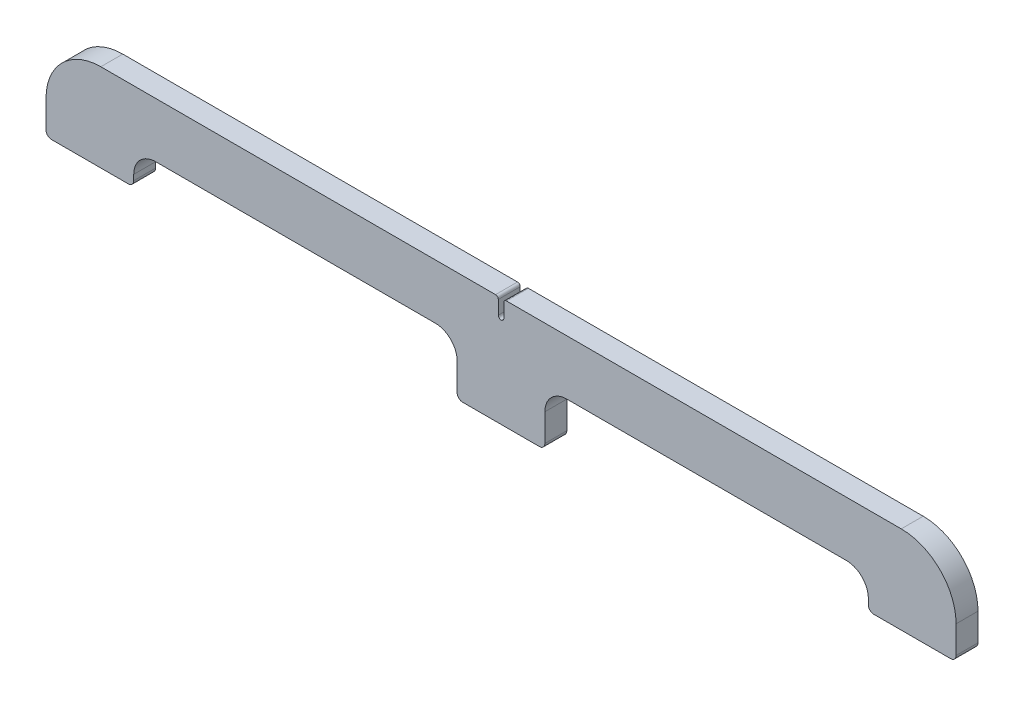
ISO-10303-21;
HEADER;
FILE_DESCRIPTION(('STEP AP214'),'2;1');
FILE_NAME('part.step','',(''),(''),'','','');
FILE_SCHEMA(('AUTOMOTIVE_DESIGN { 1 0 10303 214 1 1 1 1 }'));
ENDSEC;
DATA;
#1=APPLICATION_CONTEXT('core data for automotive mechanical design processes');
#2=APPLICATION_PROTOCOL_DEFINITION('international standard','automotive_design',2000,#1);
#3=PRODUCT_CONTEXT('',#1,'mechanical');
#4=PRODUCT('Part','Part','',(#3));
#5=PRODUCT_RELATED_PRODUCT_CATEGORY('part','',(#4));
#6=PRODUCT_DEFINITION_FORMATION('','',#4);
#7=PRODUCT_DEFINITION_CONTEXT('part definition',#1,'design');
#8=PRODUCT_DEFINITION('design','',#6,#7);
#9=PRODUCT_DEFINITION_SHAPE('','',#8);
#10=(LENGTH_UNIT() NAMED_UNIT(*) SI_UNIT(.MILLI.,.METRE.));
#11=(NAMED_UNIT(*) PLANE_ANGLE_UNIT() SI_UNIT($,.RADIAN.));
#12=(NAMED_UNIT(*) SI_UNIT($,.STERADIAN.) SOLID_ANGLE_UNIT());
#13=UNCERTAINTY_MEASURE_WITH_UNIT(LENGTH_MEASURE(1.E-05),#10,'distance_accuracy_value','');
#14=(GEOMETRIC_REPRESENTATION_CONTEXT(3) GLOBAL_UNCERTAINTY_ASSIGNED_CONTEXT((#13)) GLOBAL_UNIT_ASSIGNED_CONTEXT((#10,
#11,#12)) REPRESENTATION_CONTEXT('',''));
#15=CARTESIAN_POINT('',(0.,0.,0.));
#16=DIRECTION('',(0.,0.,1.));
#17=DIRECTION('',(1.,0.,0.));
#18=AXIS2_PLACEMENT_3D('',#15,#16,#17);
#19=CARTESIAN_POINT('',(131.7625,12.7,3.175));
#20=DIRECTION('',(0.,-1.,0.));
#21=DIRECTION('',(0.,0.,-1.));
#22=AXIS2_PLACEMENT_3D('',#19,#20,#21);
#23=PLANE('',#22);
#24=DIRECTION('',(-1.,0.,0.));
#25=VECTOR('',#24,1.);
#26=CARTESIAN_POINT('',(131.7625,12.7,3.175));
#27=LINE('',#26,#25);
#28=CARTESIAN_POINT('',(-1.58749999999999,12.7,3.175));
#29=VERTEX_POINT('',#28);
#30=CARTESIAN_POINT('',(-115.8875,12.7,3.175));
#31=VERTEX_POINT('',#30);
#32=EDGE_CURVE('E357',#29,#31,#27,.T.);
#33=ORIENTED_EDGE('',*,*,#32,.F.);
#34=DIRECTION('',(0.,0.,1.));
#35=VECTOR('',#34,1.);
#36=CARTESIAN_POINT('',(-1.58749999999999,12.7,3.175));
#37=LINE('',#36,#35);
#38=CARTESIAN_POINT('',(-1.58749999999999,12.7,-3.175));
#39=VERTEX_POINT('',#38);
#40=EDGE_CURVE('E11',#29,#39,#37,.F.);
#41=ORIENTED_EDGE('',*,*,#40,.T.);
#42=DIRECTION('',(-1.,0.,0.));
#43=VECTOR('',#42,1.);
#44=CARTESIAN_POINT('',(131.7625,12.7,-3.175));
#45=LINE('',#44,#43);
#46=CARTESIAN_POINT('',(-115.8875,12.7,-3.175));
#47=VERTEX_POINT('',#46);
#48=EDGE_CURVE('E361',#39,#47,#45,.T.);
#49=ORIENTED_EDGE('',*,*,#48,.T.);
#50=DIRECTION('',(0.,0.,1.));
#51=VECTOR('',#50,1.);
#52=CARTESIAN_POINT('',(-115.8875,12.7,3.175));
#53=LINE('',#52,#51);
#54=EDGE_CURVE('E371',#47,#31,#53,.T.);
#55=ORIENTED_EDGE('',*,*,#54,.T.);
#56=EDGE_LOOP('',(#33,#41,#49,#55));
#57=FACE_BOUND('',#56,.T.);
#58=ADVANCED_FACE('F34',(#57),#23,.F.);
#59=CARTESIAN_POINT('',(131.7625,-12.7,3.175));
#60=DIRECTION('',(0.,1.,0.));
#61=DIRECTION('',(0.,0.,1.));
#62=AXIS2_PLACEMENT_3D('',#59,#60,#61);
#63=PLANE('',#62);
#64=DIRECTION('',(-1.,0.,0.));
#65=VECTOR('',#64,1.);
#66=CARTESIAN_POINT('',(131.7625,-12.7,-3.175));
#67=LINE('',#66,#65);
#68=CARTESIAN_POINT('',(130.175,-12.7,-3.175));
#69=VERTEX_POINT('',#68);
#70=CARTESIAN_POINT('',(107.95,-12.7,-3.175));
#71=VERTEX_POINT('',#70);
#72=EDGE_CURVE('E366',#69,#71,#67,.T.);
#73=ORIENTED_EDGE('',*,*,#72,.F.);
#74=DIRECTION('',(0.,0.,-1.));
#75=VECTOR('',#74,1.);
#76=CARTESIAN_POINT('',(130.175,-12.7,3.175));
#77=LINE('',#76,#75);
#78=CARTESIAN_POINT('',(130.175,-12.7,3.175));
#79=VERTEX_POINT('',#78);
#80=EDGE_CURVE('E439',#69,#79,#77,.F.);
#81=ORIENTED_EDGE('',*,*,#80,.T.);
#82=DIRECTION('',(-1.,0.,0.));
#83=VECTOR('',#82,1.);
#84=CARTESIAN_POINT('',(131.7625,-12.7,3.175));
#85=LINE('',#84,#83);
#86=CARTESIAN_POINT('',(107.95,-12.7,3.175));
#87=VERTEX_POINT('',#86);
#88=EDGE_CURVE('E354',#79,#87,#85,.T.);
#89=ORIENTED_EDGE('',*,*,#88,.T.);
#90=DIRECTION('',(0.,0.,1.));
#91=VECTOR('',#90,1.);
#92=CARTESIAN_POINT('',(107.95,-12.7,3.175));
#93=LINE('',#92,#91);
#94=EDGE_CURVE('E437',#87,#71,#93,.F.);
#95=ORIENTED_EDGE('',*,*,#94,.T.);
#96=EDGE_LOOP('',(#73,#81,#89,#95));
#97=FACE_BOUND('',#96,.T.);
#98=ADVANCED_FACE('F483',(#97),#63,.F.);
#99=CARTESIAN_POINT('',(-107.95,-12.7,3.175));
#100=VERTEX_POINT('',#99);
#101=CARTESIAN_POINT('',(-130.175,-12.7,3.175));
#102=VERTEX_POINT('',#101);
#103=EDGE_CURVE('E350',#100,#102,#85,.T.);
#104=ORIENTED_EDGE('',*,*,#103,.T.);
#105=DIRECTION('',(0.,0.,-1.));
#106=VECTOR('',#105,1.);
#107=CARTESIAN_POINT('',(-130.175,-12.7,3.175));
#108=LINE('',#107,#106);
#109=CARTESIAN_POINT('',(-130.175,-12.7,-3.175));
#110=VERTEX_POINT('',#109);
#111=EDGE_CURVE('E393',#102,#110,#108,.T.);
#112=ORIENTED_EDGE('',*,*,#111,.T.);
#113=CARTESIAN_POINT('',(-107.95,-12.7,-3.175));
#114=VERTEX_POINT('',#113);
#115=EDGE_CURVE('E365',#114,#110,#67,.T.);
#116=ORIENTED_EDGE('',*,*,#115,.F.);
#117=DIRECTION('',(0.,0.,1.));
#118=VECTOR('',#117,1.);
#119=CARTESIAN_POINT('',(-107.95,-12.7,3.175));
#120=LINE('',#119,#118);
#121=EDGE_CURVE('E390',#114,#100,#120,.T.);
#122=ORIENTED_EDGE('',*,*,#121,.T.);
#123=EDGE_LOOP('',(#104,#112,#116,#122));
#124=FACE_BOUND('',#123,.T.);
#125=ADVANCED_FACE('F555',(#124),#63,.F.);
#126=CARTESIAN_POINT('',(131.7625,-12.7,-3.175));
#127=DIRECTION('',(0.,0.,1.));
#128=DIRECTION('',(1.,0.,0.));
#129=AXIS2_PLACEMENT_3D('',#126,#127,#128);
#130=PLANE('',#129);
#131=DIRECTION('',(0.,-1.,0.));
#132=VECTOR('',#131,1.);
#133=CARTESIAN_POINT('',(0.79375,12.7,-3.175));
#134=LINE('',#133,#132);
#135=CARTESIAN_POINT('',(0.79375,11.90625,-3.175));
#136=VERTEX_POINT('',#135);
#137=CARTESIAN_POINT('',(0.79375,7.93750000000001,-3.175));
#138=VERTEX_POINT('',#137);
#139=EDGE_CURVE('E231',#136,#138,#134,.T.);
#140=ORIENTED_EDGE('',*,*,#139,.F.);
#141=CARTESIAN_POINT('',(1.5875,11.90625,-3.175));
#142=DIRECTION('',(0.,0.,1.));
#143=DIRECTION('',(1.,0.,0.));
#144=AXIS2_PLACEMENT_3D('',#141,#142,#143);
#145=CIRCLE('',#144,0.79375);
#146=CARTESIAN_POINT('',(1.58749999999999,12.7,-3.175));
#147=VERTEX_POINT('',#146);
#148=EDGE_CURVE('E447',#136,#147,#145,.F.);
#149=ORIENTED_EDGE('',*,*,#148,.T.);
#150=CARTESIAN_POINT('',(115.8875,12.7,-3.175));
#151=VERTEX_POINT('',#150);
#152=EDGE_CURVE('E362',#151,#147,#45,.T.);
#153=ORIENTED_EDGE('',*,*,#152,.F.);
#154=CARTESIAN_POINT('',(115.8875,-3.175,-3.175));
#155=DIRECTION('',(0.,0.,1.));
#156=DIRECTION('',(1.,0.,0.));
#157=AXIS2_PLACEMENT_3D('',#154,#155,#156);
#158=CIRCLE('',#157,15.875);
#159=CARTESIAN_POINT('',(131.7625,-3.175,-3.175));
#160=VERTEX_POINT('',#159);
#161=EDGE_CURVE('E381',#151,#160,#158,.F.);
#162=ORIENTED_EDGE('',*,*,#161,.T.);
#163=DIRECTION('',(0.,1.,0.));
#164=VECTOR('',#163,1.);
#165=CARTESIAN_POINT('',(131.7625,-12.7,-3.175));
#166=LINE('',#165,#164);
#167=CARTESIAN_POINT('',(131.7625,-11.1125,-3.175));
#168=VERTEX_POINT('',#167);
#169=EDGE_CURVE('E344',#168,#160,#166,.T.);
#170=ORIENTED_EDGE('',*,*,#169,.F.);
#171=CARTESIAN_POINT('',(130.175,-11.1125,-3.175));
#172=DIRECTION('',(0.,0.,1.));
#173=DIRECTION('',(1.,0.,0.));
#174=AXIS2_PLACEMENT_3D('',#171,#172,#173);
#175=CIRCLE('',#174,1.5875);
#176=EDGE_CURVE('E398',#168,#69,#175,.F.);
#177=ORIENTED_EDGE('',*,*,#176,.T.);
#178=ORIENTED_EDGE('',*,*,#72,.T.);
#179=CARTESIAN_POINT('',(107.95,-11.1125,-3.175));
#180=DIRECTION('',(0.,0.,1.));
#181=DIRECTION('',(1.,0.,0.));
#182=AXIS2_PLACEMENT_3D('',#179,#180,#181);
#183=CIRCLE('',#182,1.5875);
#184=CARTESIAN_POINT('',(106.3625,-11.1125,-3.175));
#185=VERTEX_POINT('',#184);
#186=EDGE_CURVE('E396',#71,#185,#183,.F.);
#187=ORIENTED_EDGE('',*,*,#186,.T.);
#188=DIRECTION('',(0.,-1.,0.));
#189=VECTOR('',#188,1.);
#190=CARTESIAN_POINT('',(106.3625,-12.7,-3.175));
#191=LINE('',#190,#189);
#192=CARTESIAN_POINT('',(106.3625,-9.525,-3.175));
#193=VERTEX_POINT('',#192);
#194=EDGE_CURVE('E277',#193,#185,#191,.T.);
#195=ORIENTED_EDGE('',*,*,#194,.F.);
#196=CARTESIAN_POINT('',(100.0125,-9.525,-3.175));
#197=DIRECTION('',(0.,0.,1.));
#198=DIRECTION('',(1.,0.,0.));
#199=AXIS2_PLACEMENT_3D('',#196,#197,#198);
#200=CIRCLE('',#199,6.35);
#201=CARTESIAN_POINT('',(100.0125,-3.175,-3.175));
#202=VERTEX_POINT('',#201);
#203=EDGE_CURVE('E274',#202,#193,#200,.F.);
#204=ORIENTED_EDGE('',*,*,#203,.F.);
#205=DIRECTION('',(1.,0.,0.));
#206=VECTOR('',#205,1.);
#207=CARTESIAN_POINT('',(19.05,-3.175,-3.175));
#208=LINE('',#207,#206);
#209=CARTESIAN_POINT('',(19.05,-3.175,-3.175));
#210=VERTEX_POINT('',#209);
#211=EDGE_CURVE('E297',#210,#202,#208,.T.);
#212=ORIENTED_EDGE('',*,*,#211,.F.);
#213=CARTESIAN_POINT('',(19.05,-9.525,-3.175));
#214=DIRECTION('',(0.,0.,1.));
#215=DIRECTION('',(1.,0.,0.));
#216=AXIS2_PLACEMENT_3D('',#213,#214,#215);
#217=CIRCLE('',#216,6.35);
#218=CARTESIAN_POINT('',(12.7,-9.52500000000004,-3.175));
#219=VERTEX_POINT('',#218);
#220=EDGE_CURVE('E267',#219,#210,#217,.F.);
#221=ORIENTED_EDGE('',*,*,#220,.F.);
#222=DIRECTION('',(0.,1.,0.));
#223=VECTOR('',#222,1.);
#224=CARTESIAN_POINT('',(12.7,-12.7,-3.175));
#225=LINE('',#224,#223);
#226=CARTESIAN_POINT('',(12.7,-17.4625,-3.175));
#227=VERTEX_POINT('',#226);
#228=EDGE_CURVE('E272',#227,#219,#225,.T.);
#229=ORIENTED_EDGE('',*,*,#228,.F.);
#230=CARTESIAN_POINT('',(11.1125,-17.4625,-3.175));
#231=DIRECTION('',(0.,0.,1.));
#232=DIRECTION('',(1.,0.,0.));
#233=AXIS2_PLACEMENT_3D('',#230,#231,#232);
#234=CIRCLE('',#233,1.5875);
#235=CARTESIAN_POINT('',(11.1125,-19.05,-3.175));
#236=VERTEX_POINT('',#235);
#237=EDGE_CURVE('E400',#227,#236,#234,.F.);
#238=ORIENTED_EDGE('',*,*,#237,.T.);
#239=DIRECTION('',(-1.,0.,0.));
#240=VECTOR('',#239,1.);
#241=CARTESIAN_POINT('',(12.7,-19.05,-3.175));
#242=LINE('',#241,#240);
#243=CARTESIAN_POINT('',(-11.1125,-19.05,-3.175));
#244=VERTEX_POINT('',#243);
#245=EDGE_CURVE('E263',#236,#244,#242,.T.);
#246=ORIENTED_EDGE('',*,*,#245,.T.);
#247=CARTESIAN_POINT('',(-11.1125,-17.4625,-3.175));
#248=DIRECTION('',(0.,0.,1.));
#249=DIRECTION('',(1.,0.,0.));
#250=AXIS2_PLACEMENT_3D('',#247,#248,#249);
#251=CIRCLE('',#250,1.5875);
#252=CARTESIAN_POINT('',(-12.7,-17.4625,-3.175));
#253=VERTEX_POINT('',#252);
#254=EDGE_CURVE('E402',#244,#253,#251,.F.);
#255=ORIENTED_EDGE('',*,*,#254,.T.);
#256=DIRECTION('',(0.,-1.,0.));
#257=VECTOR('',#256,1.);
#258=CARTESIAN_POINT('',(-12.7,-12.7,-3.175));
#259=LINE('',#258,#257);
#260=CARTESIAN_POINT('',(-12.7,-9.52500000000004,-3.175));
#261=VERTEX_POINT('',#260);
#262=EDGE_CURVE('E306',#261,#253,#259,.T.);
#263=ORIENTED_EDGE('',*,*,#262,.F.);
#264=CARTESIAN_POINT('',(-19.05,-9.525,-3.175));
#265=DIRECTION('',(0.,0.,1.));
#266=DIRECTION('',(1.,0.,0.));
#267=AXIS2_PLACEMENT_3D('',#264,#265,#266);
#268=CIRCLE('',#267,6.35);
#269=CARTESIAN_POINT('',(-19.05,-3.175,-3.175));
#270=VERTEX_POINT('',#269);
#271=EDGE_CURVE('E309',#270,#261,#268,.F.);
#272=ORIENTED_EDGE('',*,*,#271,.F.);
#273=DIRECTION('',(1.,0.,0.));
#274=VECTOR('',#273,1.);
#275=CARTESIAN_POINT('',(-100.0125,-3.175,-3.175));
#276=LINE('',#275,#274);
#277=CARTESIAN_POINT('',(-100.0125,-3.175,-3.175));
#278=VERTEX_POINT('',#277);
#279=EDGE_CURVE('E312',#278,#270,#276,.T.);
#280=ORIENTED_EDGE('',*,*,#279,.F.);
#281=CARTESIAN_POINT('',(-100.0125,-9.525,-3.175));
#282=DIRECTION('',(0.,0.,1.));
#283=DIRECTION('',(1.,0.,0.));
#284=AXIS2_PLACEMENT_3D('',#281,#282,#283);
#285=CIRCLE('',#284,6.35);
#286=CARTESIAN_POINT('',(-106.3625,-9.525,-3.175));
#287=VERTEX_POINT('',#286);
#288=EDGE_CURVE('E315',#287,#278,#285,.F.);
#289=ORIENTED_EDGE('',*,*,#288,.F.);
#290=DIRECTION('',(0.,1.,0.));
#291=VECTOR('',#290,1.);
#292=CARTESIAN_POINT('',(-106.3625,-12.7,-3.175));
#293=LINE('',#292,#291);
#294=CARTESIAN_POINT('',(-106.3625,-11.1125,-3.175));
#295=VERTEX_POINT('',#294);
#296=EDGE_CURVE('E318',#295,#287,#293,.T.);
#297=ORIENTED_EDGE('',*,*,#296,.F.);
#298=CARTESIAN_POINT('',(-107.95,-11.1125,-3.175));
#299=DIRECTION('',(0.,0.,1.));
#300=DIRECTION('',(1.,0.,0.));
#301=AXIS2_PLACEMENT_3D('',#298,#299,#300);
#302=CIRCLE('',#301,1.5875);
#303=EDGE_CURVE('E404',#295,#114,#302,.F.);
#304=ORIENTED_EDGE('',*,*,#303,.T.);
#305=ORIENTED_EDGE('',*,*,#115,.T.);
#306=CARTESIAN_POINT('',(-130.175,-11.1125,-3.175));
#307=DIRECTION('',(0.,0.,1.));
#308=DIRECTION('',(1.,0.,0.));
#309=AXIS2_PLACEMENT_3D('',#306,#307,#308);
#310=CIRCLE('',#309,1.5875);
#311=CARTESIAN_POINT('',(-131.7625,-11.1125,-3.175));
#312=VERTEX_POINT('',#311);
#313=EDGE_CURVE('E406',#110,#312,#310,.F.);
#314=ORIENTED_EDGE('',*,*,#313,.T.);
#315=DIRECTION('',(0.,1.,0.));
#316=VECTOR('',#315,1.);
#317=CARTESIAN_POINT('',(-131.7625,-12.7,-3.175));
#318=LINE('',#317,#316);
#319=CARTESIAN_POINT('',(-131.7625,-3.175,-3.175));
#320=VERTEX_POINT('',#319);
#321=EDGE_CURVE('E337',#312,#320,#318,.T.);
#322=ORIENTED_EDGE('',*,*,#321,.T.);
#323=CARTESIAN_POINT('',(-115.8875,-3.175,-3.175));
#324=DIRECTION('',(0.,0.,1.));
#325=DIRECTION('',(1.,0.,0.));
#326=AXIS2_PLACEMENT_3D('',#323,#324,#325);
#327=CIRCLE('',#326,15.875);
#328=EDGE_CURVE('E384',#320,#47,#327,.F.);
#329=ORIENTED_EDGE('',*,*,#328,.T.);
#330=ORIENTED_EDGE('',*,*,#48,.F.);
#331=CARTESIAN_POINT('',(-1.5875,11.90625,-3.175));
#332=DIRECTION('',(0.,0.,1.));
#333=DIRECTION('',(1.,0.,0.));
#334=AXIS2_PLACEMENT_3D('',#331,#332,#333);
#335=CIRCLE('',#334,0.79375);
#336=CARTESIAN_POINT('',(-0.79375,11.90625,-3.175));
#337=VERTEX_POINT('',#336);
#338=EDGE_CURVE('E445',#39,#337,#335,.F.);
#339=ORIENTED_EDGE('',*,*,#338,.T.);
#340=DIRECTION('',(0.,1.,0.));
#341=VECTOR('',#340,1.);
#342=CARTESIAN_POINT('',(-0.79375,12.7,-3.175));
#343=LINE('',#342,#341);
#344=CARTESIAN_POINT('',(-0.793750000000001,7.93750000000001,-3.175));
#345=VERTEX_POINT('',#344);
#346=EDGE_CURVE('E252',#345,#337,#343,.T.);
#347=ORIENTED_EDGE('',*,*,#346,.F.);
#348=CARTESIAN_POINT('',(0.,7.93750000000001,-3.175));
#349=DIRECTION('',(0.,0.,-1.));
#350=DIRECTION('',(-1.,0.,0.));
#351=AXIS2_PLACEMENT_3D('',#348,#349,#350);
#352=CIRCLE('',#351,0.79375);
#353=EDGE_CURVE('E241',#138,#345,#352,.T.);
#354=ORIENTED_EDGE('',*,*,#353,.F.);
#355=EDGE_LOOP('',(#140,#149,#153,#162,#170,#177,#178,#187,#195,#204,#212,#221,#229,#238,#246,
#255,#263,#272,#280,#289,#297,#304,#305,#314,#322,#329,#330,#339,#347,#354));
#356=FACE_BOUND('',#355,.T.);
#357=ADVANCED_FACE('F254',(#356),#130,.F.);
#358=ORIENTED_EDGE('',*,*,#152,.T.);
#359=DIRECTION('',(0.,0.,-1.));
#360=VECTOR('',#359,1.);
#361=CARTESIAN_POINT('',(1.58749999999999,12.7,3.175));
#362=LINE('',#361,#360);
#363=CARTESIAN_POINT('',(1.58749999999999,12.7,3.175));
#364=VERTEX_POINT('',#363);
#365=EDGE_CURVE('E449',#147,#364,#362,.F.);
#366=ORIENTED_EDGE('',*,*,#365,.T.);
#367=CARTESIAN_POINT('',(115.8875,12.7,3.175));
#368=VERTEX_POINT('',#367);
#369=EDGE_CURVE('E358',#368,#364,#27,.T.);
#370=ORIENTED_EDGE('',*,*,#369,.F.);
#371=DIRECTION('',(0.,0.,1.));
#372=VECTOR('',#371,1.);
#373=CARTESIAN_POINT('',(115.8875,12.7,-3.175));
#374=LINE('',#373,#372);
#375=EDGE_CURVE('E369',#368,#151,#374,.F.);
#376=ORIENTED_EDGE('',*,*,#375,.T.);
#377=EDGE_LOOP('',(#358,#366,#370,#376));
#378=FACE_BOUND('',#377,.T.);
#379=ADVANCED_FACE('F465',(#378),#23,.F.);
#380=CARTESIAN_POINT('',(131.7625,-12.7,3.175));
#381=DIRECTION('',(0.,0.,-1.));
#382=DIRECTION('',(-1.,0.,0.));
#383=AXIS2_PLACEMENT_3D('',#380,#381,#382);
#384=PLANE('',#383);
#385=ORIENTED_EDGE('',*,*,#369,.T.);
#386=CARTESIAN_POINT('',(1.5875,11.90625,3.175));
#387=DIRECTION('',(0.,0.,-1.));
#388=DIRECTION('',(-1.,0.,0.));
#389=AXIS2_PLACEMENT_3D('',#386,#387,#388);
#390=CIRCLE('',#389,0.79375);
#391=CARTESIAN_POINT('',(0.79375,11.90625,3.175));
#392=VERTEX_POINT('',#391);
#393=EDGE_CURVE('E452',#364,#392,#390,.F.);
#394=ORIENTED_EDGE('',*,*,#393,.T.);
#395=DIRECTION('',(0.,1.,0.));
#396=VECTOR('',#395,1.);
#397=CARTESIAN_POINT('',(0.79375,12.7,3.175));
#398=LINE('',#397,#396);
#399=CARTESIAN_POINT('',(0.793750000000012,7.93750000000001,3.175));
#400=VERTEX_POINT('',#399);
#401=EDGE_CURVE('E260',#400,#392,#398,.T.);
#402=ORIENTED_EDGE('',*,*,#401,.F.);
#403=CARTESIAN_POINT('',(0.,7.93750000000001,3.175));
#404=DIRECTION('',(0.,0.,-1.));
#405=DIRECTION('',(-1.,0.,0.));
#406=AXIS2_PLACEMENT_3D('',#403,#404,#405);
#407=CIRCLE('',#406,0.79375);
#408=CARTESIAN_POINT('',(-0.793750000000001,7.93750000000001,3.175));
#409=VERTEX_POINT('',#408);
#410=EDGE_CURVE('E250',#409,#400,#407,.F.);
#411=ORIENTED_EDGE('',*,*,#410,.F.);
#412=DIRECTION('',(0.,-1.,0.));
#413=VECTOR('',#412,1.);
#414=CARTESIAN_POINT('',(-0.79375,12.7,3.175));
#415=LINE('',#414,#413);
#416=CARTESIAN_POINT('',(-0.79375,11.90625,3.175));
#417=VERTEX_POINT('',#416);
#418=EDGE_CURVE('E242',#417,#409,#415,.T.);
#419=ORIENTED_EDGE('',*,*,#418,.F.);
#420=CARTESIAN_POINT('',(-1.5875,11.90625,3.175));
#421=DIRECTION('',(0.,0.,-1.));
#422=DIRECTION('',(-1.,0.,0.));
#423=AXIS2_PLACEMENT_3D('',#420,#421,#422);
#424=CIRCLE('',#423,0.79375);
#425=EDGE_CURVE('E49',#417,#29,#424,.F.);
#426=ORIENTED_EDGE('',*,*,#425,.T.);
#427=ORIENTED_EDGE('',*,*,#32,.T.);
#428=CARTESIAN_POINT('',(-115.8875,-3.175,3.175));
#429=DIRECTION('',(0.,0.,-1.));
#430=DIRECTION('',(-1.,0.,0.));
#431=AXIS2_PLACEMENT_3D('',#428,#429,#430);
#432=CIRCLE('',#431,15.875);
#433=CARTESIAN_POINT('',(-131.7625,-3.175,3.175));
#434=VERTEX_POINT('',#433);
#435=EDGE_CURVE('E376',#31,#434,#432,.F.);
#436=ORIENTED_EDGE('',*,*,#435,.T.);
#437=DIRECTION('',(0.,-1.,0.));
#438=VECTOR('',#437,1.);
#439=CARTESIAN_POINT('',(-131.7625,-12.7,3.175));
#440=LINE('',#439,#438);
#441=CARTESIAN_POINT('',(-131.7625,-11.1125,3.175));
#442=VERTEX_POINT('',#441);
#443=EDGE_CURVE('E347',#434,#442,#440,.T.);
#444=ORIENTED_EDGE('',*,*,#443,.T.);
#445=CARTESIAN_POINT('',(-130.175,-11.1125,3.175));
#446=DIRECTION('',(0.,0.,-1.));
#447=DIRECTION('',(-1.,0.,0.));
#448=AXIS2_PLACEMENT_3D('',#445,#446,#447);
#449=CIRCLE('',#448,1.5875);
#450=EDGE_CURVE('E420',#442,#102,#449,.F.);
#451=ORIENTED_EDGE('',*,*,#450,.T.);
#452=ORIENTED_EDGE('',*,*,#103,.F.);
#453=CARTESIAN_POINT('',(-107.95,-11.1125,3.175));
#454=DIRECTION('',(0.,0.,-1.));
#455=DIRECTION('',(-1.,0.,0.));
#456=AXIS2_PLACEMENT_3D('',#453,#454,#455);
#457=CIRCLE('',#456,1.5875);
#458=CARTESIAN_POINT('',(-106.3625,-11.1125,3.175));
#459=VERTEX_POINT('',#458);
#460=EDGE_CURVE('E418',#100,#459,#457,.F.);
#461=ORIENTED_EDGE('',*,*,#460,.T.);
#462=DIRECTION('',(0.,-1.,0.));
#463=VECTOR('',#462,1.);
#464=CARTESIAN_POINT('',(-106.3625,-12.7,3.175));
#465=LINE('',#464,#463);
#466=CARTESIAN_POINT('',(-106.3625,-9.525,3.175));
#467=VERTEX_POINT('',#466);
#468=EDGE_CURVE('E320',#467,#459,#465,.T.);
#469=ORIENTED_EDGE('',*,*,#468,.F.);
#470=CARTESIAN_POINT('',(-100.0125,-9.525,3.175));
#471=DIRECTION('',(0.,0.,1.));
#472=DIRECTION('',(-1.,0.,0.));
#473=AXIS2_PLACEMENT_3D('',#470,#471,#472);
#474=CIRCLE('',#473,6.35);
#475=CARTESIAN_POINT('',(-100.0125,-3.175,3.175));
#476=VERTEX_POINT('',#475);
#477=EDGE_CURVE('E331',#476,#467,#474,.T.);
#478=ORIENTED_EDGE('',*,*,#477,.F.);
#479=DIRECTION('',(-1.,0.,0.));
#480=VECTOR('',#479,1.);
#481=CARTESIAN_POINT('',(-100.0125,-3.175,3.175));
#482=LINE('',#481,#480);
#483=CARTESIAN_POINT('',(-19.05,-3.175,3.175));
#484=VERTEX_POINT('',#483);
#485=EDGE_CURVE('E328',#484,#476,#482,.T.);
#486=ORIENTED_EDGE('',*,*,#485,.F.);
#487=CARTESIAN_POINT('',(-19.05,-9.525,3.175));
#488=DIRECTION('',(0.,0.,1.));
#489=DIRECTION('',(-1.,0.,0.));
#490=AXIS2_PLACEMENT_3D('',#487,#488,#489);
#491=CIRCLE('',#490,6.35);
#492=CARTESIAN_POINT('',(-12.7,-9.52500000000004,3.175));
#493=VERTEX_POINT('',#492);
#494=EDGE_CURVE('E325',#493,#484,#491,.T.);
#495=ORIENTED_EDGE('',*,*,#494,.F.);
#496=DIRECTION('',(0.,1.,0.));
#497=VECTOR('',#496,1.);
#498=CARTESIAN_POINT('',(-12.7,-12.7,3.175));
#499=LINE('',#498,#497);
#500=CARTESIAN_POINT('',(-12.7,-17.4625,3.175));
#501=VERTEX_POINT('',#500);
#502=EDGE_CURVE('E323',#501,#493,#499,.T.);
#503=ORIENTED_EDGE('',*,*,#502,.F.);
#504=CARTESIAN_POINT('',(-11.1125,-17.4625,3.175));
#505=DIRECTION('',(0.,0.,-1.));
#506=DIRECTION('',(-1.,0.,0.));
#507=AXIS2_PLACEMENT_3D('',#504,#505,#506);
#508=CIRCLE('',#507,1.5875);
#509=CARTESIAN_POINT('',(-11.1125,-19.05,3.175));
#510=VERTEX_POINT('',#509);
#511=EDGE_CURVE('E416',#501,#510,#508,.F.);
#512=ORIENTED_EDGE('',*,*,#511,.T.);
#513=DIRECTION('',(-1.,0.,0.));
#514=VECTOR('',#513,1.);
#515=CARTESIAN_POINT('',(12.7,-19.05,3.175));
#516=LINE('',#515,#514);
#517=CARTESIAN_POINT('',(11.1125,-19.05,3.175));
#518=VERTEX_POINT('',#517);
#519=EDGE_CURVE('E264',#518,#510,#516,.T.);
#520=ORIENTED_EDGE('',*,*,#519,.F.);
#521=CARTESIAN_POINT('',(11.1125,-17.4625,3.175));
#522=DIRECTION('',(0.,0.,-1.));
#523=DIRECTION('',(-1.,0.,0.));
#524=AXIS2_PLACEMENT_3D('',#521,#522,#523);
#525=CIRCLE('',#524,1.5875);
#526=CARTESIAN_POINT('',(12.7,-17.4625,3.175));
#527=VERTEX_POINT('',#526);
#528=EDGE_CURVE('E414',#518,#527,#525,.F.);
#529=ORIENTED_EDGE('',*,*,#528,.T.);
#530=DIRECTION('',(0.,-1.,0.));
#531=VECTOR('',#530,1.);
#532=CARTESIAN_POINT('',(12.7,-12.7,3.175));
#533=LINE('',#532,#531);
#534=CARTESIAN_POINT('',(12.7,-9.52500000000004,3.175));
#535=VERTEX_POINT('',#534);
#536=EDGE_CURVE('E288',#535,#527,#533,.T.);
#537=ORIENTED_EDGE('',*,*,#536,.F.);
#538=CARTESIAN_POINT('',(19.05,-9.525,3.175));
#539=DIRECTION('',(0.,0.,1.));
#540=DIRECTION('',(-1.,0.,0.));
#541=AXIS2_PLACEMENT_3D('',#538,#539,#540);
#542=CIRCLE('',#541,6.35);
#543=CARTESIAN_POINT('',(19.05,-3.175,3.175));
#544=VERTEX_POINT('',#543);
#545=EDGE_CURVE('E285',#544,#535,#542,.T.);
#546=ORIENTED_EDGE('',*,*,#545,.F.);
#547=DIRECTION('',(-1.,0.,0.));
#548=VECTOR('',#547,1.);
#549=CARTESIAN_POINT('',(19.05,-3.175,3.175));
#550=LINE('',#549,#548);
#551=CARTESIAN_POINT('',(100.0125,-3.175,3.175));
#552=VERTEX_POINT('',#551);
#553=EDGE_CURVE('E282',#552,#544,#550,.T.);
#554=ORIENTED_EDGE('',*,*,#553,.F.);
#555=CARTESIAN_POINT('',(100.0125,-9.525,3.175));
#556=DIRECTION('',(0.,0.,1.));
#557=DIRECTION('',(-1.,0.,0.));
#558=AXIS2_PLACEMENT_3D('',#555,#556,#557);
#559=CIRCLE('',#558,6.35);
#560=CARTESIAN_POINT('',(106.3625,-9.525,3.175));
#561=VERTEX_POINT('',#560);
#562=EDGE_CURVE('E280',#561,#552,#559,.T.);
#563=ORIENTED_EDGE('',*,*,#562,.F.);
#564=DIRECTION('',(0.,1.,0.));
#565=VECTOR('',#564,1.);
#566=CARTESIAN_POINT('',(106.3625,-12.7,3.175));
#567=LINE('',#566,#565);
#568=CARTESIAN_POINT('',(106.3625,-11.1125,3.175));
#569=VERTEX_POINT('',#568);
#570=EDGE_CURVE('E291',#569,#561,#567,.T.);
#571=ORIENTED_EDGE('',*,*,#570,.F.);
#572=CARTESIAN_POINT('',(107.95,-11.1125,3.175));
#573=DIRECTION('',(0.,0.,-1.));
#574=DIRECTION('',(-1.,0.,0.));
#575=AXIS2_PLACEMENT_3D('',#572,#573,#574);
#576=CIRCLE('',#575,1.5875);
#577=EDGE_CURVE('E410',#569,#87,#576,.F.);
#578=ORIENTED_EDGE('',*,*,#577,.T.);
#579=ORIENTED_EDGE('',*,*,#88,.F.);
#580=CARTESIAN_POINT('',(130.175,-11.1125,3.175));
#581=DIRECTION('',(0.,0.,-1.));
#582=DIRECTION('',(-1.,0.,0.));
#583=AXIS2_PLACEMENT_3D('',#580,#581,#582);
#584=CIRCLE('',#583,1.5875);
#585=CARTESIAN_POINT('',(131.7625,-11.1125,3.175));
#586=VERTEX_POINT('',#585);
#587=EDGE_CURVE('E412',#79,#586,#584,.F.);
#588=ORIENTED_EDGE('',*,*,#587,.T.);
#589=DIRECTION('',(0.,-1.,0.));
#590=VECTOR('',#589,1.);
#591=CARTESIAN_POINT('',(131.7625,-12.7,3.175));
#592=LINE('',#591,#590);
#593=CARTESIAN_POINT('',(131.7625,-3.175,3.175));
#594=VERTEX_POINT('',#593);
#595=EDGE_CURVE('E346',#594,#586,#592,.T.);
#596=ORIENTED_EDGE('',*,*,#595,.F.);
#597=CARTESIAN_POINT('',(115.8875,-3.175,3.175));
#598=DIRECTION('',(0.,0.,-1.));
#599=DIRECTION('',(-1.,0.,0.));
#600=AXIS2_PLACEMENT_3D('',#597,#598,#599);
#601=CIRCLE('',#600,15.875);
#602=EDGE_CURVE('E374',#594,#368,#601,.F.);
#603=ORIENTED_EDGE('',*,*,#602,.T.);
#604=EDGE_LOOP('',(#385,#394,#402,#411,#419,#426,#427,#436,#444,#451,#452,#461,#469,#478,#486,
#495,#503,#512,#520,#529,#537,#546,#554,#563,#571,#578,#579,#588,#596,#603));
#605=FACE_BOUND('',#604,.T.);
#606=ADVANCED_FACE('F456',(#605),#384,.F.);
#607=CARTESIAN_POINT('',(131.7625,-12.7,-3.175));
#608=DIRECTION('',(1.,0.,0.));
#609=DIRECTION('',(0.,0.,-1.));
#610=AXIS2_PLACEMENT_3D('',#607,#608,#609);
#611=PLANE('',#610);
#612=ORIENTED_EDGE('',*,*,#595,.T.);
#613=DIRECTION('',(0.,0.,-1.));
#614=VECTOR('',#613,1.);
#615=CARTESIAN_POINT('',(131.7625,-11.1125,-3.175));
#616=LINE('',#615,#614);
#617=EDGE_CURVE('E434',#586,#168,#616,.T.);
#618=ORIENTED_EDGE('',*,*,#617,.T.);
#619=ORIENTED_EDGE('',*,*,#169,.T.);
#620=DIRECTION('',(0.,0.,1.));
#621=VECTOR('',#620,1.);
#622=CARTESIAN_POINT('',(131.7625,-3.175,3.175));
#623=LINE('',#622,#621);
#624=EDGE_CURVE('E387',#160,#594,#623,.T.);
#625=ORIENTED_EDGE('',*,*,#624,.T.);
#626=EDGE_LOOP('',(#612,#618,#619,#625));
#627=FACE_BOUND('',#626,.T.);
#628=ADVANCED_FACE('F474',(#627),#611,.T.);
#629=CARTESIAN_POINT('',(-131.7625,-12.7,-3.175));
#630=DIRECTION('',(1.,0.,0.));
#631=DIRECTION('',(0.,0.,-1.));
#632=AXIS2_PLACEMENT_3D('',#629,#630,#631);
#633=PLANE('',#632);
#634=ORIENTED_EDGE('',*,*,#321,.F.);
#635=DIRECTION('',(0.,0.,-1.));
#636=VECTOR('',#635,1.);
#637=CARTESIAN_POINT('',(-131.7625,-11.1125,-3.175));
#638=LINE('',#637,#636);
#639=EDGE_CURVE('E408',#312,#442,#638,.F.);
#640=ORIENTED_EDGE('',*,*,#639,.T.);
#641=ORIENTED_EDGE('',*,*,#443,.F.);
#642=DIRECTION('',(0.,0.,1.));
#643=VECTOR('',#642,1.);
#644=CARTESIAN_POINT('',(-131.7625,-3.175,-3.175));
#645=LINE('',#644,#643);
#646=EDGE_CURVE('E378',#434,#320,#645,.F.);
#647=ORIENTED_EDGE('',*,*,#646,.T.);
#648=EDGE_LOOP('',(#634,#640,#641,#647));
#649=FACE_BOUND('',#648,.T.);
#650=ADVANCED_FACE('F564',(#649),#633,.F.);
#651=CARTESIAN_POINT('',(-106.3625,-12.7,-3.176));
#652=DIRECTION('',(-1.,0.,0.));
#653=DIRECTION('',(0.,0.,1.));
#654=AXIS2_PLACEMENT_3D('',#651,#652,#653);
#655=PLANE('',#654);
#656=ORIENTED_EDGE('',*,*,#468,.T.);
#657=DIRECTION('',(0.,0.,1.));
#658=VECTOR('',#657,1.);
#659=CARTESIAN_POINT('',(-106.3625,-11.1125,-3.176));
#660=LINE('',#659,#658);
#661=EDGE_CURVE('E422',#459,#295,#660,.F.);
#662=ORIENTED_EDGE('',*,*,#661,.T.);
#663=ORIENTED_EDGE('',*,*,#296,.T.);
#664=DIRECTION('',(0.,0.,1.));
#665=VECTOR('',#664,1.);
#666=CARTESIAN_POINT('',(-106.3625,-9.525,-3.176));
#667=LINE('',#666,#665);
#668=EDGE_CURVE('E335',#287,#467,#667,.T.);
#669=ORIENTED_EDGE('',*,*,#668,.T.);
#670=EDGE_LOOP('',(#656,#662,#663,#669));
#671=FACE_BOUND('',#670,.T.);
#672=ADVANCED_FACE('F544',(#671),#655,.F.);
#673=CARTESIAN_POINT('',(-100.0125,-9.525,-3.176));
#674=DIRECTION('',(0.,0.,1.));
#675=DIRECTION('',(1.,0.,0.));
#676=AXIS2_PLACEMENT_3D('',#673,#674,#675);
#677=CYLINDRICAL_SURFACE('',#676,6.35);
#678=ORIENTED_EDGE('',*,*,#288,.T.);
#679=DIRECTION('',(0.,0.,1.));
#680=VECTOR('',#679,1.);
#681=CARTESIAN_POINT('',(-100.0125,-3.175,-3.176));
#682=LINE('',#681,#680);
#683=EDGE_CURVE('E338',#278,#476,#682,.T.);
#684=ORIENTED_EDGE('',*,*,#683,.T.);
#685=ORIENTED_EDGE('',*,*,#477,.T.);
#686=ORIENTED_EDGE('',*,*,#668,.F.);
#687=EDGE_LOOP('',(#678,#684,#685,#686));
#688=FACE_BOUND('',#687,.T.);
#689=ADVANCED_FACE('F541',(#688),#677,.F.);
#690=CARTESIAN_POINT('',(-100.0125,-3.175,-3.176));
#691=DIRECTION('',(0.,1.,0.));
#692=DIRECTION('',(0.,0.,1.));
#693=AXIS2_PLACEMENT_3D('',#690,#691,#692);
#694=PLANE('',#693);
#695=ORIENTED_EDGE('',*,*,#279,.T.);
#696=DIRECTION('',(0.,0.,1.));
#697=VECTOR('',#696,1.);
#698=CARTESIAN_POINT('',(-19.05,-3.175,-3.176));
#699=LINE('',#698,#697);
#700=EDGE_CURVE('E340',#270,#484,#699,.T.);
#701=ORIENTED_EDGE('',*,*,#700,.T.);
#702=ORIENTED_EDGE('',*,*,#485,.T.);
#703=ORIENTED_EDGE('',*,*,#683,.F.);
#704=EDGE_LOOP('',(#695,#701,#702,#703));
#705=FACE_BOUND('',#704,.T.);
#706=ADVANCED_FACE('F536',(#705),#694,.F.);
#707=CARTESIAN_POINT('',(-19.05,-9.525,-3.176));
#708=DIRECTION('',(0.,0.,1.));
#709=DIRECTION('',(1.,0.,0.));
#710=AXIS2_PLACEMENT_3D('',#707,#708,#709);
#711=CYLINDRICAL_SURFACE('',#710,6.35);
#712=ORIENTED_EDGE('',*,*,#271,.T.);
#713=DIRECTION('',(0.,0.,1.));
#714=VECTOR('',#713,1.);
#715=CARTESIAN_POINT('',(-12.7,-9.52500000000004,-3.176));
#716=LINE('',#715,#714);
#717=EDGE_CURVE('E334',#261,#493,#716,.T.);
#718=ORIENTED_EDGE('',*,*,#717,.T.);
#719=ORIENTED_EDGE('',*,*,#494,.T.);
#720=ORIENTED_EDGE('',*,*,#700,.F.);
#721=EDGE_LOOP('',(#712,#718,#719,#720));
#722=FACE_BOUND('',#721,.T.);
#723=ADVANCED_FACE('F531',(#722),#711,.F.);
#724=CARTESIAN_POINT('',(-12.7,-12.7,-3.176));
#725=DIRECTION('',(1.,0.,0.));
#726=DIRECTION('',(0.,1.,0.));
#727=AXIS2_PLACEMENT_3D('',#724,#725,#726);
#728=PLANE('',#727);
#729=ORIENTED_EDGE('',*,*,#262,.T.);
#730=DIRECTION('',(0.,0.,-1.));
#731=VECTOR('',#730,1.);
#732=CARTESIAN_POINT('',(-12.7,-17.4625,3.175));
#733=LINE('',#732,#731);
#734=EDGE_CURVE('E429',#253,#501,#733,.F.);
#735=ORIENTED_EDGE('',*,*,#734,.T.);
#736=ORIENTED_EDGE('',*,*,#502,.T.);
#737=ORIENTED_EDGE('',*,*,#717,.F.);
#738=EDGE_LOOP('',(#729,#735,#736,#737));
#739=FACE_BOUND('',#738,.T.);
#740=ADVANCED_FACE('F529',(#739),#728,.F.);
#741=CARTESIAN_POINT('',(100.0125,-9.525,-3.176));
#742=DIRECTION('',(0.,0.,1.));
#743=DIRECTION('',(1.,0.,0.));
#744=AXIS2_PLACEMENT_3D('',#741,#742,#743);
#745=CYLINDRICAL_SURFACE('',#744,6.35);
#746=ORIENTED_EDGE('',*,*,#203,.T.);
#747=DIRECTION('',(0.,0.,1.));
#748=VECTOR('',#747,1.);
#749=CARTESIAN_POINT('',(106.3625,-9.525,-3.176));
#750=LINE('',#749,#748);
#751=EDGE_CURVE('E294',#193,#561,#750,.T.);
#752=ORIENTED_EDGE('',*,*,#751,.T.);
#753=ORIENTED_EDGE('',*,*,#562,.T.);
#754=DIRECTION('',(0.,0.,1.));
#755=VECTOR('',#754,1.);
#756=CARTESIAN_POINT('',(100.0125,-3.175,-3.176));
#757=LINE('',#756,#755);
#758=EDGE_CURVE('E293',#202,#552,#757,.T.);
#759=ORIENTED_EDGE('',*,*,#758,.F.);
#760=EDGE_LOOP('',(#746,#752,#753,#759));
#761=FACE_BOUND('',#760,.T.);
#762=ADVANCED_FACE('F498',(#761),#745,.F.);
#763=CARTESIAN_POINT('',(106.3625,-12.7,-3.176));
#764=DIRECTION('',(1.,0.,0.));
#765=DIRECTION('',(0.,0.,-1.));
#766=AXIS2_PLACEMENT_3D('',#763,#764,#765);
#767=PLANE('',#766);
#768=ORIENTED_EDGE('',*,*,#194,.T.);
#769=DIRECTION('',(0.,0.,1.));
#770=VECTOR('',#769,1.);
#771=CARTESIAN_POINT('',(106.3625,-11.1125,-3.176));
#772=LINE('',#771,#770);
#773=EDGE_CURVE('E441',#185,#569,#772,.T.);
#774=ORIENTED_EDGE('',*,*,#773,.T.);
#775=ORIENTED_EDGE('',*,*,#570,.T.);
#776=ORIENTED_EDGE('',*,*,#751,.F.);
#777=EDGE_LOOP('',(#768,#774,#775,#776));
#778=FACE_BOUND('',#777,.T.);
#779=ADVANCED_FACE('F492',(#778),#767,.F.);
#780=CARTESIAN_POINT('',(12.7,-12.7,-3.176));
#781=DIRECTION('',(-1.,0.,0.));
#782=DIRECTION('',(0.,-1.,0.));
#783=AXIS2_PLACEMENT_3D('',#780,#781,#782);
#784=PLANE('',#783);
#785=ORIENTED_EDGE('',*,*,#536,.T.);
#786=DIRECTION('',(0.,0.,-1.));
#787=VECTOR('',#786,1.);
#788=CARTESIAN_POINT('',(12.7,-17.4625,-3.175));
#789=LINE('',#788,#787);
#790=EDGE_CURVE('E431',#527,#227,#789,.T.);
#791=ORIENTED_EDGE('',*,*,#790,.T.);
#792=ORIENTED_EDGE('',*,*,#228,.T.);
#793=DIRECTION('',(0.,0.,1.));
#794=VECTOR('',#793,1.);
#795=CARTESIAN_POINT('',(12.7,-9.52500000000004,-3.176));
#796=LINE('',#795,#794);
#797=EDGE_CURVE('E298',#219,#535,#796,.T.);
#798=ORIENTED_EDGE('',*,*,#797,.T.);
#799=EDGE_LOOP('',(#785,#791,#792,#798));
#800=FACE_BOUND('',#799,.T.);
#801=ADVANCED_FACE('F509',(#800),#784,.F.);
#802=CARTESIAN_POINT('',(19.05,-9.525,-3.176));
#803=DIRECTION('',(0.,0.,1.));
#804=DIRECTION('',(1.,0.,0.));
#805=AXIS2_PLACEMENT_3D('',#802,#803,#804);
#806=CYLINDRICAL_SURFACE('',#805,6.35);
#807=ORIENTED_EDGE('',*,*,#220,.T.);
#808=DIRECTION('',(0.,0.,1.));
#809=VECTOR('',#808,1.);
#810=CARTESIAN_POINT('',(19.05,-3.175,-3.176));
#811=LINE('',#810,#809);
#812=EDGE_CURVE('E300',#210,#544,#811,.T.);
#813=ORIENTED_EDGE('',*,*,#812,.T.);
#814=ORIENTED_EDGE('',*,*,#545,.T.);
#815=ORIENTED_EDGE('',*,*,#797,.F.);
#816=EDGE_LOOP('',(#807,#813,#814,#815));
#817=FACE_BOUND('',#816,.T.);
#818=ADVANCED_FACE('F505',(#817),#806,.F.);
#819=CARTESIAN_POINT('',(19.05,-3.175,-3.176));
#820=DIRECTION('',(0.,1.,0.));
#821=DIRECTION('',(0.,0.,1.));
#822=AXIS2_PLACEMENT_3D('',#819,#820,#821);
#823=PLANE('',#822);
#824=ORIENTED_EDGE('',*,*,#211,.T.);
#825=ORIENTED_EDGE('',*,*,#758,.T.);
#826=ORIENTED_EDGE('',*,*,#553,.T.);
#827=ORIENTED_EDGE('',*,*,#812,.F.);
#828=EDGE_LOOP('',(#824,#825,#826,#827));
#829=FACE_BOUND('',#828,.T.);
#830=ADVANCED_FACE('F501',(#829),#823,.F.);
#831=CARTESIAN_POINT('',(-115.8875,-3.175,3.175));
#832=DIRECTION('',(0.,0.,1.));
#833=DIRECTION('',(1.,0.,0.));
#834=AXIS2_PLACEMENT_3D('',#831,#832,#833);
#835=CYLINDRICAL_SURFACE('',#834,15.875);
#836=ORIENTED_EDGE('',*,*,#328,.F.);
#837=ORIENTED_EDGE('',*,*,#646,.F.);
#838=ORIENTED_EDGE('',*,*,#435,.F.);
#839=ORIENTED_EDGE('',*,*,#54,.F.);
#840=EDGE_LOOP('',(#836,#837,#838,#839));
#841=FACE_BOUND('',#840,.T.);
#842=ADVANCED_FACE('F570',(#841),#835,.T.);
#843=CARTESIAN_POINT('',(115.8875,-3.175,-3.175));
#844=DIRECTION('',(0.,0.,-1.));
#845=DIRECTION('',(-1.,0.,0.));
#846=AXIS2_PLACEMENT_3D('',#843,#844,#845);
#847=CYLINDRICAL_SURFACE('',#846,15.875);
#848=ORIENTED_EDGE('',*,*,#161,.F.);
#849=ORIENTED_EDGE('',*,*,#375,.F.);
#850=ORIENTED_EDGE('',*,*,#602,.F.);
#851=ORIENTED_EDGE('',*,*,#624,.F.);
#852=EDGE_LOOP('',(#848,#849,#850,#851));
#853=FACE_BOUND('',#852,.T.);
#854=ADVANCED_FACE('F469',(#853),#847,.T.);
#855=CARTESIAN_POINT('',(12.7,-19.05,3.175));
#856=DIRECTION('',(0.,-1.,0.));
#857=DIRECTION('',(0.,0.,-1.));
#858=AXIS2_PLACEMENT_3D('',#855,#856,#857);
#859=PLANE('',#858);
#860=ORIENTED_EDGE('',*,*,#519,.T.);
#861=DIRECTION('',(0.,0.,-1.));
#862=VECTOR('',#861,1.);
#863=CARTESIAN_POINT('',(-11.1125,-19.05,-3.175));
#864=LINE('',#863,#862);
#865=EDGE_CURVE('E426',#510,#244,#864,.T.);
#866=ORIENTED_EDGE('',*,*,#865,.T.);
#867=ORIENTED_EDGE('',*,*,#245,.F.);
#868=DIRECTION('',(0.,0.,-1.));
#869=VECTOR('',#868,1.);
#870=CARTESIAN_POINT('',(11.1125,-19.05,3.175));
#871=LINE('',#870,#869);
#872=EDGE_CURVE('E424',#236,#518,#871,.F.);
#873=ORIENTED_EDGE('',*,*,#872,.T.);
#874=EDGE_LOOP('',(#860,#866,#867,#873));
#875=FACE_BOUND('',#874,.T.);
#876=ADVANCED_FACE('F518',(#875),#859,.T.);
#877=CARTESIAN_POINT('',(-130.175,-11.1125,3.175));
#878=DIRECTION('',(0.,0.,-1.));
#879=DIRECTION('',(-1.,0.,0.));
#880=AXIS2_PLACEMENT_3D('',#877,#878,#879);
#881=CYLINDRICAL_SURFACE('',#880,1.5875);
#882=ORIENTED_EDGE('',*,*,#450,.F.);
#883=ORIENTED_EDGE('',*,*,#639,.F.);
#884=ORIENTED_EDGE('',*,*,#313,.F.);
#885=ORIENTED_EDGE('',*,*,#111,.F.);
#886=EDGE_LOOP('',(#882,#883,#884,#885));
#887=FACE_BOUND('',#886,.T.);
#888=ADVANCED_FACE('F561',(#887),#881,.T.);
#889=CARTESIAN_POINT('',(-107.95,-11.1125,3.175));
#890=DIRECTION('',(0.,0.,1.));
#891=DIRECTION('',(1.,0.,0.));
#892=AXIS2_PLACEMENT_3D('',#889,#890,#891);
#893=CYLINDRICAL_SURFACE('',#892,1.5875);
#894=ORIENTED_EDGE('',*,*,#303,.F.);
#895=ORIENTED_EDGE('',*,*,#661,.F.);
#896=ORIENTED_EDGE('',*,*,#460,.F.);
#897=ORIENTED_EDGE('',*,*,#121,.F.);
#898=EDGE_LOOP('',(#894,#895,#896,#897));
#899=FACE_BOUND('',#898,.T.);
#900=ADVANCED_FACE('F551',(#899),#893,.T.);
#901=CARTESIAN_POINT('',(-11.1125,-17.4625,3.175));
#902=DIRECTION('',(0.,0.,1.));
#903=DIRECTION('',(1.,0.,0.));
#904=AXIS2_PLACEMENT_3D('',#901,#902,#903);
#905=CYLINDRICAL_SURFACE('',#904,1.5875);
#906=ORIENTED_EDGE('',*,*,#511,.F.);
#907=ORIENTED_EDGE('',*,*,#734,.F.);
#908=ORIENTED_EDGE('',*,*,#254,.F.);
#909=ORIENTED_EDGE('',*,*,#865,.F.);
#910=EDGE_LOOP('',(#906,#907,#908,#909));
#911=FACE_BOUND('',#910,.T.);
#912=ADVANCED_FACE('F525',(#911),#905,.T.);
#913=CARTESIAN_POINT('',(11.1125,-17.4625,-3.176));
#914=DIRECTION('',(0.,0.,1.));
#915=DIRECTION('',(1.,0.,0.));
#916=AXIS2_PLACEMENT_3D('',#913,#914,#915);
#917=CYLINDRICAL_SURFACE('',#916,1.5875);
#918=ORIENTED_EDGE('',*,*,#528,.F.);
#919=ORIENTED_EDGE('',*,*,#872,.F.);
#920=ORIENTED_EDGE('',*,*,#237,.F.);
#921=ORIENTED_EDGE('',*,*,#790,.F.);
#922=EDGE_LOOP('',(#918,#919,#920,#921));
#923=FACE_BOUND('',#922,.T.);
#924=ADVANCED_FACE('F514',(#923),#917,.T.);
#925=CARTESIAN_POINT('',(130.175,-11.1125,-3.175));
#926=DIRECTION('',(0.,0.,1.));
#927=DIRECTION('',(1.,0.,0.));
#928=AXIS2_PLACEMENT_3D('',#925,#926,#927);
#929=CYLINDRICAL_SURFACE('',#928,1.5875);
#930=ORIENTED_EDGE('',*,*,#587,.F.);
#931=ORIENTED_EDGE('',*,*,#80,.F.);
#932=ORIENTED_EDGE('',*,*,#176,.F.);
#933=ORIENTED_EDGE('',*,*,#617,.F.);
#934=EDGE_LOOP('',(#930,#931,#932,#933));
#935=FACE_BOUND('',#934,.T.);
#936=ADVANCED_FACE('F479',(#935),#929,.T.);
#937=CARTESIAN_POINT('',(107.95,-11.1125,-3.176));
#938=DIRECTION('',(0.,0.,1.));
#939=DIRECTION('',(1.,0.,0.));
#940=AXIS2_PLACEMENT_3D('',#937,#938,#939);
#941=CYLINDRICAL_SURFACE('',#940,1.5875);
#942=ORIENTED_EDGE('',*,*,#186,.F.);
#943=ORIENTED_EDGE('',*,*,#94,.F.);
#944=ORIENTED_EDGE('',*,*,#577,.F.);
#945=ORIENTED_EDGE('',*,*,#773,.F.);
#946=EDGE_LOOP('',(#942,#943,#944,#945));
#947=FACE_BOUND('',#946,.T.);
#948=ADVANCED_FACE('F490',(#947),#941,.T.);
#949=CARTESIAN_POINT('',(-0.79375,12.7,3.176));
#950=DIRECTION('',(-1.,0.,0.));
#951=DIRECTION('',(0.,-1.,0.));
#952=AXIS2_PLACEMENT_3D('',#949,#950,#951);
#953=PLANE('',#952);
#954=ORIENTED_EDGE('',*,*,#346,.T.);
#955=DIRECTION('',(0.,0.,1.));
#956=VECTOR('',#955,1.);
#957=CARTESIAN_POINT('',(-0.79375,11.90625,3.176));
#958=LINE('',#957,#956);
#959=EDGE_CURVE('E42',#337,#417,#958,.T.);
#960=ORIENTED_EDGE('',*,*,#959,.T.);
#961=ORIENTED_EDGE('',*,*,#418,.T.);
#962=DIRECTION('',(0.,0.,-1.));
#963=VECTOR('',#962,1.);
#964=CARTESIAN_POINT('',(-0.793750000000001,7.93750000000001,3.176));
#965=LINE('',#964,#963);
#966=EDGE_CURVE('E251',#409,#345,#965,.T.);
#967=ORIENTED_EDGE('',*,*,#966,.T.);
#968=EDGE_LOOP('',(#954,#960,#961,#967));
#969=FACE_BOUND('',#968,.T.);
#970=ADVANCED_FACE('F454',(#969),#953,.F.);
#971=CARTESIAN_POINT('',(0.,7.93750000000001,3.176));
#972=DIRECTION('',(0.,0.,-1.));
#973=DIRECTION('',(-1.,0.,0.));
#974=AXIS2_PLACEMENT_3D('',#971,#972,#973);
#975=CYLINDRICAL_SURFACE('',#974,0.79375);
#976=ORIENTED_EDGE('',*,*,#410,.T.);
#977=DIRECTION('',(0.,0.,-1.));
#978=VECTOR('',#977,1.);
#979=CARTESIAN_POINT('',(0.79375,7.93750000000001,3.176));
#980=LINE('',#979,#978);
#981=EDGE_CURVE('E235',#400,#138,#980,.T.);
#982=ORIENTED_EDGE('',*,*,#981,.T.);
#983=ORIENTED_EDGE('',*,*,#353,.T.);
#984=ORIENTED_EDGE('',*,*,#966,.F.);
#985=EDGE_LOOP('',(#976,#982,#983,#984));
#986=FACE_BOUND('',#985,.T.);
#987=ADVANCED_FACE('F246',(#986),#975,.F.);
#988=CARTESIAN_POINT('',(0.79375,12.7,3.176));
#989=DIRECTION('',(1.,0.,0.));
#990=DIRECTION('',(0.,1.,0.));
#991=AXIS2_PLACEMENT_3D('',#988,#989,#990);
#992=PLANE('',#991);
#993=ORIENTED_EDGE('',*,*,#401,.T.);
#994=DIRECTION('',(0.,0.,-1.));
#995=VECTOR('',#994,1.);
#996=CARTESIAN_POINT('',(0.79375,11.90625,3.176));
#997=LINE('',#996,#995);
#998=EDGE_CURVE('E238',#392,#136,#997,.T.);
#999=ORIENTED_EDGE('',*,*,#998,.T.);
#1000=ORIENTED_EDGE('',*,*,#139,.T.);
#1001=ORIENTED_EDGE('',*,*,#981,.F.);
#1002=EDGE_LOOP('',(#993,#999,#1000,#1001));
#1003=FACE_BOUND('',#1002,.T.);
#1004=ADVANCED_FACE('F234',(#1003),#992,.F.);
#1005=CARTESIAN_POINT('',(1.5875,11.90625,3.176));
#1006=DIRECTION('',(0.,0.,-1.));
#1007=DIRECTION('',(-1.,0.,0.));
#1008=AXIS2_PLACEMENT_3D('',#1005,#1006,#1007);
#1009=CYLINDRICAL_SURFACE('',#1008,0.79375);
#1010=ORIENTED_EDGE('',*,*,#393,.F.);
#1011=ORIENTED_EDGE('',*,*,#365,.F.);
#1012=ORIENTED_EDGE('',*,*,#148,.F.);
#1013=ORIENTED_EDGE('',*,*,#998,.F.);
#1014=EDGE_LOOP('',(#1010,#1011,#1012,#1013));
#1015=FACE_BOUND('',#1014,.T.);
#1016=ADVANCED_FACE('F460',(#1015),#1009,.T.);
#1017=CARTESIAN_POINT('',(-1.5875,11.90625,3.176));
#1018=DIRECTION('',(0.,0.,1.));
#1019=DIRECTION('',(1.,0.,0.));
#1020=AXIS2_PLACEMENT_3D('',#1017,#1018,#1019);
#1021=CYLINDRICAL_SURFACE('',#1020,0.79375);
#1022=ORIENTED_EDGE('',*,*,#338,.F.);
#1023=ORIENTED_EDGE('',*,*,#40,.F.);
#1024=ORIENTED_EDGE('',*,*,#425,.F.);
#1025=ORIENTED_EDGE('',*,*,#959,.F.);
#1026=EDGE_LOOP('',(#1022,#1023,#1024,#1025));
#1027=FACE_BOUND('',#1026,.T.);
#1028=ADVANCED_FACE('F36',(#1027),#1021,.T.);
#1029=CLOSED_SHELL('',(#58,#98,#125,#357,#379,#606,#628,#650,#672,#689,#706,#723,#740,#762,#779,
#801,#818,#830,#842,#854,#876,#888,#900,#912,#924,#936,#948,#970,#987,#1004,#1016,#1028));
#1030=MANIFOLD_SOLID_BREP('B2',#1029);
#1031=ADVANCED_BREP_SHAPE_REPRESENTATION('',(#18,#1030),#14);
#1032=SHAPE_DEFINITION_REPRESENTATION(#9,#1031);
ENDSEC;
END-ISO-10303-21;
